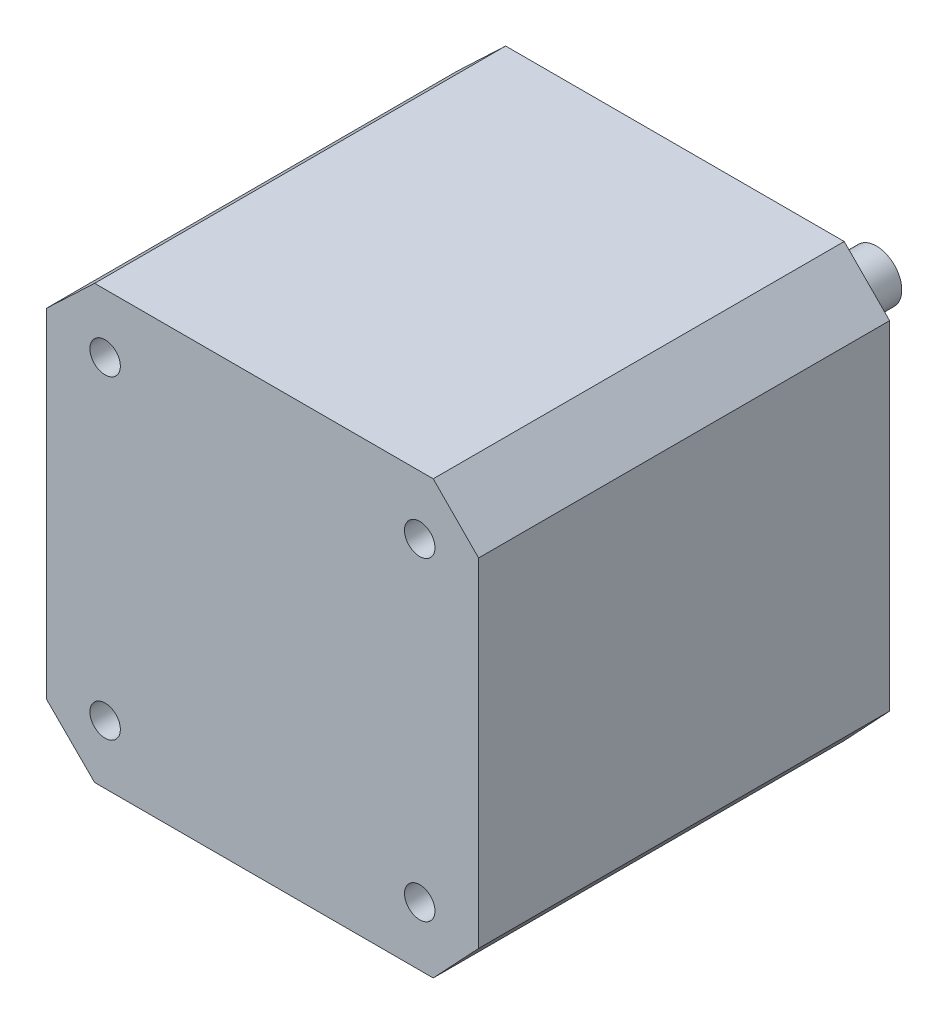
ISO-10303-21;
HEADER;
FILE_DESCRIPTION(('STEP AP214'),'2;1');
FILE_NAME('part.step','',(''),(''),'','','');
FILE_SCHEMA(('AUTOMOTIVE_DESIGN { 1 0 10303 214 1 1 1 1 }'));
ENDSEC;
DATA;
#1=APPLICATION_CONTEXT('core data for automotive mechanical design processes');
#2=APPLICATION_PROTOCOL_DEFINITION('international standard','automotive_design',2000,#1);
#3=PRODUCT_CONTEXT('',#1,'mechanical');
#4=PRODUCT('Part','Part','',(#3));
#5=PRODUCT_RELATED_PRODUCT_CATEGORY('part','',(#4));
#6=PRODUCT_DEFINITION_FORMATION('','',#4);
#7=PRODUCT_DEFINITION_CONTEXT('part definition',#1,'design');
#8=PRODUCT_DEFINITION('design','',#6,#7);
#9=PRODUCT_DEFINITION_SHAPE('','',#8);
#10=(LENGTH_UNIT() NAMED_UNIT(*) SI_UNIT(.MILLI.,.METRE.));
#11=(NAMED_UNIT(*) PLANE_ANGLE_UNIT() SI_UNIT($,.RADIAN.));
#12=(NAMED_UNIT(*) SI_UNIT($,.STERADIAN.) SOLID_ANGLE_UNIT());
#13=UNCERTAINTY_MEASURE_WITH_UNIT(LENGTH_MEASURE(1.E-05),#10,'distance_accuracy_value','');
#14=(GEOMETRIC_REPRESENTATION_CONTEXT(3) GLOBAL_UNCERTAINTY_ASSIGNED_CONTEXT((#13)) GLOBAL_UNIT_ASSIGNED_CONTEXT((#10,
#11,#12)) REPRESENTATION_CONTEXT('',''));
#15=CARTESIAN_POINT('',(0.,0.,0.));
#16=DIRECTION('',(0.,0.,1.));
#17=DIRECTION('',(1.,0.,0.));
#18=AXIS2_PLACEMENT_3D('',#15,#16,#17);
#19=CARTESIAN_POINT('',(21.3,-4.1,-2.));
#20=DIRECTION('',(0.,0.,-1.));
#21=DIRECTION('',(-1.,0.,0.));
#22=AXIS2_PLACEMENT_3D('',#19,#20,#21);
#23=PLANE('',#22);
#24=CARTESIAN_POINT('',(21.3,-4.1,-2.));
#25=DIRECTION('',(0.,0.,-1.));
#26=DIRECTION('',(-1.,0.,0.));
#27=AXIS2_PLACEMENT_3D('',#24,#25,#26);
#28=CIRCLE('',#27,11.);
#29=CARTESIAN_POINT('',(10.3,-4.1,-2.));
#30=VERTEX_POINT('',#29);
#31=EDGE_CURVE('E366',#30,#30,#28,.T.);
#32=ORIENTED_EDGE('',*,*,#31,.T.);
#33=EDGE_LOOP('',(#32));
#34=FACE_BOUND('',#33,.T.);
#35=CARTESIAN_POINT('',(21.3,-4.1,-2.));
#36=DIRECTION('',(0.,0.,-1.));
#37=DIRECTION('',(-1.,0.,0.));
#38=AXIS2_PLACEMENT_3D('',#35,#36,#37);
#39=CIRCLE('',#38,2.5);
#40=CARTESIAN_POINT('',(18.8,-4.1,-2.));
#41=VERTEX_POINT('',#40);
#42=EDGE_CURVE('E363',#41,#41,#39,.T.);
#43=ORIENTED_EDGE('',*,*,#42,.F.);
#44=EDGE_LOOP('',(#43));
#45=FACE_BOUND('',#44,.T.);
#46=ADVANCED_FACE('F44',(#34,#45),#23,.T.);
#47=CARTESIAN_POINT('',(0.,17.2,0.));
#48=DIRECTION('',(0.,0.,-1.));
#49=DIRECTION('',(-1.,0.,0.));
#50=AXIS2_PLACEMENT_3D('',#47,#48,#49);
#51=PLANE('',#50);
#52=CARTESIAN_POINT('',(36.8,11.4,0.));
#53=DIRECTION('',(0.,0.,1.));
#54=DIRECTION('',(1.,0.,0.));
#55=AXIS2_PLACEMENT_3D('',#52,#53,#54);
#56=CIRCLE('',#55,1.5);
#57=CARTESIAN_POINT('',(38.3,11.4,0.));
#58=VERTEX_POINT('',#57);
#59=EDGE_CURVE('E181',#58,#58,#56,.T.);
#60=ORIENTED_EDGE('',*,*,#59,.T.);
#61=EDGE_LOOP('',(#60));
#62=FACE_BOUND('',#61,.T.);
#63=CARTESIAN_POINT('',(5.8,-19.6,0.));
#64=DIRECTION('',(0.,0.,1.));
#65=DIRECTION('',(1.,0.,0.));
#66=AXIS2_PLACEMENT_3D('',#63,#64,#65);
#67=CIRCLE('',#66,1.5);
#68=CARTESIAN_POINT('',(7.3,-19.6,0.));
#69=VERTEX_POINT('',#68);
#70=EDGE_CURVE('E193',#69,#69,#67,.T.);
#71=ORIENTED_EDGE('',*,*,#70,.T.);
#72=EDGE_LOOP('',(#71));
#73=FACE_BOUND('',#72,.T.);
#74=CARTESIAN_POINT('',(5.79999999999999,11.4,0.));
#75=DIRECTION('',(0.,0.,1.));
#76=DIRECTION('',(1.,0.,0.));
#77=AXIS2_PLACEMENT_3D('',#74,#75,#76);
#78=CIRCLE('',#77,1.5);
#79=CARTESIAN_POINT('',(7.29999999999999,11.4,0.));
#80=VERTEX_POINT('',#79);
#81=EDGE_CURVE('E199',#80,#80,#78,.T.);
#82=ORIENTED_EDGE('',*,*,#81,.T.);
#83=EDGE_LOOP('',(#82));
#84=FACE_BOUND('',#83,.T.);
#85=CARTESIAN_POINT('',(36.8,-19.6,0.));
#86=DIRECTION('',(0.,0.,1.));
#87=DIRECTION('',(1.,0.,0.));
#88=AXIS2_PLACEMENT_3D('',#85,#86,#87);
#89=CIRCLE('',#88,1.5);
#90=CARTESIAN_POINT('',(38.3,-19.6,0.));
#91=VERTEX_POINT('',#90);
#92=EDGE_CURVE('E187',#91,#91,#89,.T.);
#93=ORIENTED_EDGE('',*,*,#92,.T.);
#94=EDGE_LOOP('',(#93));
#95=FACE_BOUND('',#94,.T.);
#96=DIRECTION('',(0.684699078492722,0.72882588586796,0.));
#97=VECTOR('',#96,1.);
#98=CARTESIAN_POINT('',(38.1281944881197,-25.4,0.));
#99=LINE('',#98,#97);
#100=CARTESIAN_POINT('',(38.1281944881197,-25.4,0.));
#101=VERTEX_POINT('',#100);
#102=CARTESIAN_POINT('',(42.6,-20.64,0.));
#103=VERTEX_POINT('',#102);
#104=EDGE_CURVE('E61',#101,#103,#99,.T.);
#105=ORIENTED_EDGE('',*,*,#104,.F.);
#106=DIRECTION('',(1.,0.,0.));
#107=VECTOR('',#106,1.);
#108=CARTESIAN_POINT('',(0.,-25.4,0.));
#109=LINE('',#108,#107);
#110=CARTESIAN_POINT('',(4.76444796255505,-25.4,0.));
#111=VERTEX_POINT('',#110);
#112=EDGE_CURVE('E125',#111,#101,#109,.T.);
#113=ORIENTED_EDGE('',*,*,#112,.F.);
#114=DIRECTION('',(0.707436926277013,-0.706776481880752,0.));
#115=VECTOR('',#114,1.);
#116=CARTESIAN_POINT('',(4.76444796255506,-25.4,0.));
#117=LINE('',#116,#115);
#118=CARTESIAN_POINT('',(0.,-20.64,0.));
#119=VERTEX_POINT('',#118);
#120=EDGE_CURVE('E174',#119,#111,#117,.T.);
#121=ORIENTED_EDGE('',*,*,#120,.F.);
#122=DIRECTION('',(0.,-1.,0.));
#123=VECTOR('',#122,1.);
#124=CARTESIAN_POINT('',(0.,-25.4,0.));
#125=LINE('',#124,#123);
#126=CARTESIAN_POINT('',(0.,12.6802455688297,0.));
#127=VERTEX_POINT('',#126);
#128=EDGE_CURVE('E138',#127,#119,#125,.T.);
#129=ORIENTED_EDGE('',*,*,#128,.F.);
#130=DIRECTION('',(-0.725491286874511,-0.688231351123418,0.));
#131=VECTOR('',#130,1.);
#132=CARTESIAN_POINT('',(4.76444796255506,17.2,0.));
#133=LINE('',#132,#131);
#134=CARTESIAN_POINT('',(4.76444796255506,17.2,0.));
#135=VERTEX_POINT('',#134);
#136=EDGE_CURVE('E158',#135,#127,#133,.T.);
#137=ORIENTED_EDGE('',*,*,#136,.F.);
#138=DIRECTION('',(-1.,0.,0.));
#139=VECTOR('',#138,1.);
#140=CARTESIAN_POINT('',(0.,17.2,0.));
#141=LINE('',#140,#139);
#142=CARTESIAN_POINT('',(38.1281944881197,17.2,0.));
#143=VERTEX_POINT('',#142);
#144=EDGE_CURVE('E48',#143,#135,#141,.T.);
#145=ORIENTED_EDGE('',*,*,#144,.F.);
#146=DIRECTION('',(-0.703326021884924,0.710867432746449,0.));
#147=VECTOR('',#146,1.);
#148=CARTESIAN_POINT('',(38.1281944881197,17.2,0.));
#149=LINE('',#148,#147);
#150=CARTESIAN_POINT('',(42.6,12.6802455688297,0.));
#151=VERTEX_POINT('',#150);
#152=EDGE_CURVE('E69',#151,#143,#149,.T.);
#153=ORIENTED_EDGE('',*,*,#152,.F.);
#154=DIRECTION('',(0.,1.,0.));
#155=VECTOR('',#154,1.);
#156=CARTESIAN_POINT('',(42.6,17.2,0.));
#157=LINE('',#156,#155);
#158=EDGE_CURVE('E141',#103,#151,#157,.T.);
#159=ORIENTED_EDGE('',*,*,#158,.F.);
#160=EDGE_LOOP('',(#105,#113,#121,#129,#137,#145,#153,#159));
#161=FACE_BOUND('',#160,.T.);
#162=CARTESIAN_POINT('',(21.3,-4.1,0.));
#163=DIRECTION('',(0.,0.,-1.));
#164=DIRECTION('',(-1.,0.,0.));
#165=AXIS2_PLACEMENT_3D('',#162,#163,#164);
#166=CIRCLE('',#165,11.);
#167=CARTESIAN_POINT('',(10.3,-4.1,0.));
#168=VERTEX_POINT('',#167);
#169=EDGE_CURVE('E362',#168,#168,#166,.T.);
#170=ORIENTED_EDGE('',*,*,#169,.F.);
#171=EDGE_LOOP('',(#170));
#172=FACE_BOUND('',#171,.T.);
#173=ADVANCED_FACE('F165',(#62,#73,#84,#95,#161,#172),#51,.T.);
#174=CARTESIAN_POINT('',(0.,17.2,40.5));
#175=DIRECTION('',(0.,0.,-1.));
#176=DIRECTION('',(-1.,0.,0.));
#177=AXIS2_PLACEMENT_3D('',#174,#175,#176);
#178=PLANE('',#177);
#179=CARTESIAN_POINT('',(36.8,-19.6,40.5));
#180=DIRECTION('',(0.,0.,1.));
#181=DIRECTION('',(1.,0.,0.));
#182=AXIS2_PLACEMENT_3D('',#179,#180,#181);
#183=CIRCLE('',#182,1.5);
#184=CARTESIAN_POINT('',(38.3,-19.6,40.5));
#185=VERTEX_POINT('',#184);
#186=EDGE_CURVE('E190',#185,#185,#183,.T.);
#187=ORIENTED_EDGE('',*,*,#186,.F.);
#188=EDGE_LOOP('',(#187));
#189=FACE_BOUND('',#188,.T.);
#190=CARTESIAN_POINT('',(5.8,11.4,40.5));
#191=DIRECTION('',(0.,0.,1.));
#192=DIRECTION('',(1.,0.,0.));
#193=AXIS2_PLACEMENT_3D('',#190,#191,#192);
#194=CIRCLE('',#193,1.5);
#195=CARTESIAN_POINT('',(7.3,11.4,40.5));
#196=VERTEX_POINT('',#195);
#197=EDGE_CURVE('E140',#196,#196,#194,.T.);
#198=ORIENTED_EDGE('',*,*,#197,.F.);
#199=EDGE_LOOP('',(#198));
#200=FACE_BOUND('',#199,.T.);
#201=DIRECTION('',(1.,0.,0.));
#202=VECTOR('',#201,1.);
#203=CARTESIAN_POINT('',(0.,-25.4,40.5));
#204=LINE('',#203,#202);
#205=CARTESIAN_POINT('',(4.76444796255506,-25.4,40.5));
#206=VERTEX_POINT('',#205);
#207=CARTESIAN_POINT('',(38.1281944881197,-25.4,40.5));
#208=VERTEX_POINT('',#207);
#209=EDGE_CURVE('E123',#206,#208,#204,.T.);
#210=ORIENTED_EDGE('',*,*,#209,.T.);
#211=DIRECTION('',(0.684699078492722,0.72882588586796,0.));
#212=VECTOR('',#211,1.);
#213=CARTESIAN_POINT('',(38.1281944881197,-25.4,40.5));
#214=LINE('',#213,#212);
#215=CARTESIAN_POINT('',(42.6,-20.64,40.5));
#216=VERTEX_POINT('',#215);
#217=EDGE_CURVE('E109',#208,#216,#214,.T.);
#218=ORIENTED_EDGE('',*,*,#217,.T.);
#219=DIRECTION('',(0.,1.,0.));
#220=VECTOR('',#219,1.);
#221=CARTESIAN_POINT('',(42.6,17.2,40.5));
#222=LINE('',#221,#220);
#223=CARTESIAN_POINT('',(42.6,12.6802455688297,40.5));
#224=VERTEX_POINT('',#223);
#225=EDGE_CURVE('E53',#216,#224,#222,.T.);
#226=ORIENTED_EDGE('',*,*,#225,.T.);
#227=DIRECTION('',(-0.703326021884924,0.710867432746449,0.));
#228=VECTOR('',#227,1.);
#229=CARTESIAN_POINT('',(38.1281944881197,17.2,40.5));
#230=LINE('',#229,#228);
#231=CARTESIAN_POINT('',(38.1281944881197,17.2,40.5));
#232=VERTEX_POINT('',#231);
#233=EDGE_CURVE('E374',#224,#232,#230,.T.);
#234=ORIENTED_EDGE('',*,*,#233,.T.);
#235=DIRECTION('',(-1.,0.,0.));
#236=VECTOR('',#235,1.);
#237=CARTESIAN_POINT('',(0.,17.2,40.5));
#238=LINE('',#237,#236);
#239=CARTESIAN_POINT('',(4.76444796255505,17.2,40.5));
#240=VERTEX_POINT('',#239);
#241=EDGE_CURVE('E13',#232,#240,#238,.T.);
#242=ORIENTED_EDGE('',*,*,#241,.T.);
#243=DIRECTION('',(-0.725491286874511,-0.688231351123418,0.));
#244=VECTOR('',#243,1.);
#245=CARTESIAN_POINT('',(4.76444796255506,17.2,40.5));
#246=LINE('',#245,#244);
#247=CARTESIAN_POINT('',(0.,12.6802455688297,40.5));
#248=VERTEX_POINT('',#247);
#249=EDGE_CURVE('E161',#240,#248,#246,.T.);
#250=ORIENTED_EDGE('',*,*,#249,.T.);
#251=DIRECTION('',(0.,-1.,0.));
#252=VECTOR('',#251,1.);
#253=CARTESIAN_POINT('',(0.,-25.4,40.5));
#254=LINE('',#253,#252);
#255=CARTESIAN_POINT('',(0.,-20.64,40.5));
#256=VERTEX_POINT('',#255);
#257=EDGE_CURVE('E132',#248,#256,#254,.T.);
#258=ORIENTED_EDGE('',*,*,#257,.T.);
#259=DIRECTION('',(0.707436926277013,-0.706776481880752,0.));
#260=VECTOR('',#259,1.);
#261=CARTESIAN_POINT('',(4.76444796255506,-25.4,40.5));
#262=LINE('',#261,#260);
#263=EDGE_CURVE('E131',#256,#206,#262,.T.);
#264=ORIENTED_EDGE('',*,*,#263,.T.);
#265=EDGE_LOOP('',(#210,#218,#226,#234,#242,#250,#258,#264));
#266=FACE_BOUND('',#265,.T.);
#267=CARTESIAN_POINT('',(5.8,-19.6,40.5));
#268=DIRECTION('',(0.,0.,1.));
#269=DIRECTION('',(1.,0.,0.));
#270=AXIS2_PLACEMENT_3D('',#267,#268,#269);
#271=CIRCLE('',#270,1.5);
#272=CARTESIAN_POINT('',(7.3,-19.6,40.5));
#273=VERTEX_POINT('',#272);
#274=EDGE_CURVE('E196',#273,#273,#271,.T.);
#275=ORIENTED_EDGE('',*,*,#274,.F.);
#276=EDGE_LOOP('',(#275));
#277=FACE_BOUND('',#276,.T.);
#278=CARTESIAN_POINT('',(36.8,11.4,40.5));
#279=DIRECTION('',(0.,0.,1.));
#280=DIRECTION('',(1.,0.,0.));
#281=AXIS2_PLACEMENT_3D('',#278,#279,#280);
#282=CIRCLE('',#281,1.5);
#283=CARTESIAN_POINT('',(38.3,11.4,40.5));
#284=VERTEX_POINT('',#283);
#285=EDGE_CURVE('E184',#284,#284,#282,.T.);
#286=ORIENTED_EDGE('',*,*,#285,.F.);
#287=EDGE_LOOP('',(#286));
#288=FACE_BOUND('',#287,.T.);
#289=ADVANCED_FACE('F128',(#189,#200,#266,#277,#288),#178,.F.);
#290=CARTESIAN_POINT('',(0.,-25.4,40.5));
#291=DIRECTION('',(1.,0.,0.));
#292=DIRECTION('',(0.,0.,-1.));
#293=AXIS2_PLACEMENT_3D('',#290,#291,#292);
#294=PLANE('',#293);
#295=ORIENTED_EDGE('',*,*,#257,.F.);
#296=DIRECTION('',(0.,0.,-1.));
#297=VECTOR('',#296,1.);
#298=CARTESIAN_POINT('',(0.,12.6802455688297,40.5));
#299=LINE('',#298,#297);
#300=EDGE_CURVE('E162',#248,#127,#299,.T.);
#301=ORIENTED_EDGE('',*,*,#300,.T.);
#302=ORIENTED_EDGE('',*,*,#128,.T.);
#303=DIRECTION('',(0.,0.,-1.));
#304=VECTOR('',#303,1.);
#305=CARTESIAN_POINT('',(0.,-20.64,40.5));
#306=LINE('',#305,#304);
#307=EDGE_CURVE('E177',#256,#119,#306,.T.);
#308=ORIENTED_EDGE('',*,*,#307,.F.);
#309=EDGE_LOOP('',(#295,#301,#302,#308));
#310=FACE_BOUND('',#309,.T.);
#311=ADVANCED_FACE('F46',(#310),#294,.F.);
#312=CARTESIAN_POINT('',(0.,-25.4,40.5));
#313=DIRECTION('',(0.,1.,0.));
#314=DIRECTION('',(0.,0.,1.));
#315=AXIS2_PLACEMENT_3D('',#312,#313,#314);
#316=PLANE('',#315);
#317=ORIENTED_EDGE('',*,*,#112,.T.);
#318=DIRECTION('',(0.,0.,-1.));
#319=VECTOR('',#318,1.);
#320=CARTESIAN_POINT('',(38.1281944881197,-25.4,40.5));
#321=LINE('',#320,#319);
#322=EDGE_CURVE('E112',#208,#101,#321,.T.);
#323=ORIENTED_EDGE('',*,*,#322,.F.);
#324=ORIENTED_EDGE('',*,*,#209,.F.);
#325=DIRECTION('',(0.,0.,-1.));
#326=VECTOR('',#325,1.);
#327=CARTESIAN_POINT('',(4.76444796255506,-25.4,40.5));
#328=LINE('',#327,#326);
#329=EDGE_CURVE('E179',#206,#111,#328,.T.);
#330=ORIENTED_EDGE('',*,*,#329,.T.);
#331=EDGE_LOOP('',(#317,#323,#324,#330));
#332=FACE_BOUND('',#331,.T.);
#333=ADVANCED_FACE('F121',(#332),#316,.F.);
#334=CARTESIAN_POINT('',(42.6,17.2,40.5));
#335=DIRECTION('',(-1.,0.,0.));
#336=DIRECTION('',(0.,0.,1.));
#337=AXIS2_PLACEMENT_3D('',#334,#335,#336);
#338=PLANE('',#337);
#339=ORIENTED_EDGE('',*,*,#225,.F.);
#340=DIRECTION('',(0.,0.,-1.));
#341=VECTOR('',#340,1.);
#342=CARTESIAN_POINT('',(42.6,-20.64,40.5));
#343=LINE('',#342,#341);
#344=EDGE_CURVE('E113',#216,#103,#343,.T.);
#345=ORIENTED_EDGE('',*,*,#344,.T.);
#346=ORIENTED_EDGE('',*,*,#158,.T.);
#347=DIRECTION('',(0.,0.,-1.));
#348=VECTOR('',#347,1.);
#349=CARTESIAN_POINT('',(42.6,12.6802455688297,40.5));
#350=LINE('',#349,#348);
#351=EDGE_CURVE('E170',#224,#151,#350,.T.);
#352=ORIENTED_EDGE('',*,*,#351,.F.);
#353=EDGE_LOOP('',(#339,#345,#346,#352));
#354=FACE_BOUND('',#353,.T.);
#355=ADVANCED_FACE('F220',(#354),#338,.F.);
#356=CARTESIAN_POINT('',(0.,17.2,40.5));
#357=DIRECTION('',(0.,-1.,0.));
#358=DIRECTION('',(0.,0.,-1.));
#359=AXIS2_PLACEMENT_3D('',#356,#357,#358);
#360=PLANE('',#359);
#361=ORIENTED_EDGE('',*,*,#241,.F.);
#362=DIRECTION('',(0.,0.,-1.));
#363=VECTOR('',#362,1.);
#364=CARTESIAN_POINT('',(38.1281944881197,17.2,40.5));
#365=LINE('',#364,#363);
#366=EDGE_CURVE('E152',#232,#143,#365,.T.);
#367=ORIENTED_EDGE('',*,*,#366,.T.);
#368=ORIENTED_EDGE('',*,*,#144,.T.);
#369=DIRECTION('',(0.,0.,-1.));
#370=VECTOR('',#369,1.);
#371=CARTESIAN_POINT('',(4.76444796255506,17.2,40.5));
#372=LINE('',#371,#370);
#373=EDGE_CURVE('E151',#240,#135,#372,.T.);
#374=ORIENTED_EDGE('',*,*,#373,.F.);
#375=EDGE_LOOP('',(#361,#367,#368,#374));
#376=FACE_BOUND('',#375,.T.);
#377=ADVANCED_FACE('F150',(#376),#360,.F.);
#378=CARTESIAN_POINT('',(5.8,11.4,40.5));
#379=DIRECTION('',(0.,0.,-1.));
#380=DIRECTION('',(-1.,0.,0.));
#381=AXIS2_PLACEMENT_3D('',#378,#379,#380);
#382=CYLINDRICAL_SURFACE('',#381,1.5);
#383=ORIENTED_EDGE('',*,*,#197,.T.);
#384=EDGE_LOOP('',(#383));
#385=FACE_BOUND('',#384,.T.);
#386=ORIENTED_EDGE('',*,*,#81,.F.);
#387=EDGE_LOOP('',(#386));
#388=FACE_BOUND('',#387,.T.);
#389=ADVANCED_FACE('F208',(#385,#388),#382,.F.);
#390=CARTESIAN_POINT('',(5.8,-19.6,40.5));
#391=DIRECTION('',(0.,0.,-1.));
#392=DIRECTION('',(-1.,0.,0.));
#393=AXIS2_PLACEMENT_3D('',#390,#391,#392);
#394=CYLINDRICAL_SURFACE('',#393,1.5);
#395=ORIENTED_EDGE('',*,*,#274,.T.);
#396=EDGE_LOOP('',(#395));
#397=FACE_BOUND('',#396,.T.);
#398=ORIENTED_EDGE('',*,*,#70,.F.);
#399=EDGE_LOOP('',(#398));
#400=FACE_BOUND('',#399,.T.);
#401=ADVANCED_FACE('F210',(#397,#400),#394,.F.);
#402=CARTESIAN_POINT('',(36.8,-19.6,40.5));
#403=DIRECTION('',(0.,0.,-1.));
#404=DIRECTION('',(-1.,0.,0.));
#405=AXIS2_PLACEMENT_3D('',#402,#403,#404);
#406=CYLINDRICAL_SURFACE('',#405,1.5);
#407=ORIENTED_EDGE('',*,*,#186,.T.);
#408=EDGE_LOOP('',(#407));
#409=FACE_BOUND('',#408,.T.);
#410=ORIENTED_EDGE('',*,*,#92,.F.);
#411=EDGE_LOOP('',(#410));
#412=FACE_BOUND('',#411,.T.);
#413=ADVANCED_FACE('F217',(#409,#412),#406,.F.);
#414=CARTESIAN_POINT('',(36.8,11.4,40.5));
#415=DIRECTION('',(0.,0.,-1.));
#416=DIRECTION('',(-1.,0.,0.));
#417=AXIS2_PLACEMENT_3D('',#414,#415,#416);
#418=CYLINDRICAL_SURFACE('',#417,1.5);
#419=ORIENTED_EDGE('',*,*,#285,.T.);
#420=EDGE_LOOP('',(#419));
#421=FACE_BOUND('',#420,.T.);
#422=ORIENTED_EDGE('',*,*,#59,.F.);
#423=EDGE_LOOP('',(#422));
#424=FACE_BOUND('',#423,.T.);
#425=ADVANCED_FACE('F251',(#421,#424),#418,.F.);
#426=CARTESIAN_POINT('',(4.76444796255506,-25.4,40.5));
#427=DIRECTION('',(0.706776481880752,0.707436926277013,0.));
#428=DIRECTION('',(-0.707436926277013,0.706776481880752,0.));
#429=AXIS2_PLACEMENT_3D('',#426,#427,#428);
#430=PLANE('',#429);
#431=ORIENTED_EDGE('',*,*,#120,.T.);
#432=ORIENTED_EDGE('',*,*,#329,.F.);
#433=ORIENTED_EDGE('',*,*,#263,.F.);
#434=ORIENTED_EDGE('',*,*,#307,.T.);
#435=EDGE_LOOP('',(#431,#432,#433,#434));
#436=FACE_BOUND('',#435,.T.);
#437=ADVANCED_FACE('F248',(#436),#430,.F.);
#438=CARTESIAN_POINT('',(4.76444796255506,17.2,40.5));
#439=DIRECTION('',(0.688231351123418,-0.725491286874511,0.));
#440=DIRECTION('',(0.725491286874511,0.688231351123418,0.));
#441=AXIS2_PLACEMENT_3D('',#438,#439,#440);
#442=PLANE('',#441);
#443=ORIENTED_EDGE('',*,*,#136,.T.);
#444=ORIENTED_EDGE('',*,*,#300,.F.);
#445=ORIENTED_EDGE('',*,*,#249,.F.);
#446=ORIENTED_EDGE('',*,*,#373,.T.);
#447=EDGE_LOOP('',(#443,#444,#445,#446));
#448=FACE_BOUND('',#447,.T.);
#449=ADVANCED_FACE('F157',(#448),#442,.F.);
#450=CARTESIAN_POINT('',(38.1281944881197,17.2,40.5));
#451=DIRECTION('',(-0.710867432746449,-0.703326021884924,0.));
#452=DIRECTION('',(0.703326021884924,-0.710867432746449,0.));
#453=AXIS2_PLACEMENT_3D('',#450,#451,#452);
#454=PLANE('',#453);
#455=ORIENTED_EDGE('',*,*,#152,.T.);
#456=ORIENTED_EDGE('',*,*,#366,.F.);
#457=ORIENTED_EDGE('',*,*,#233,.F.);
#458=ORIENTED_EDGE('',*,*,#351,.T.);
#459=EDGE_LOOP('',(#455,#456,#457,#458));
#460=FACE_BOUND('',#459,.T.);
#461=ADVANCED_FACE('F243',(#460),#454,.F.);
#462=CARTESIAN_POINT('',(38.1281944881197,-25.4,40.5));
#463=DIRECTION('',(-0.72882588586796,0.684699078492722,0.));
#464=DIRECTION('',(-0.684699078492722,-0.72882588586796,0.));
#465=AXIS2_PLACEMENT_3D('',#462,#463,#464);
#466=PLANE('',#465);
#467=ORIENTED_EDGE('',*,*,#104,.T.);
#468=ORIENTED_EDGE('',*,*,#344,.F.);
#469=ORIENTED_EDGE('',*,*,#217,.F.);
#470=ORIENTED_EDGE('',*,*,#322,.T.);
#471=EDGE_LOOP('',(#467,#468,#469,#470));
#472=FACE_BOUND('',#471,.T.);
#473=ADVANCED_FACE('F111',(#472),#466,.F.);
#474=CARTESIAN_POINT('',(21.3,-4.1,-2.));
#475=DIRECTION('',(0.,0.,1.));
#476=DIRECTION('',(1.,0.,0.));
#477=AXIS2_PLACEMENT_3D('',#474,#475,#476);
#478=CYLINDRICAL_SURFACE('',#477,11.);
#479=ORIENTED_EDGE('',*,*,#31,.F.);
#480=EDGE_LOOP('',(#479));
#481=FACE_BOUND('',#480,.T.);
#482=ORIENTED_EDGE('',*,*,#169,.T.);
#483=EDGE_LOOP('',(#482));
#484=FACE_BOUND('',#483,.T.);
#485=ADVANCED_FACE('F237',(#481,#484),#478,.T.);
#486=CARTESIAN_POINT('',(21.3,-4.1,-20.));
#487=DIRECTION('',(0.,0.,1.));
#488=DIRECTION('',(1.,0.,0.));
#489=AXIS2_PLACEMENT_3D('',#486,#487,#488);
#490=CYLINDRICAL_SURFACE('',#489,2.5);
#491=CARTESIAN_POINT('',(21.3,-4.1,-20.));
#492=DIRECTION('',(0.,0.,-1.));
#493=DIRECTION('',(-1.,0.,0.));
#494=AXIS2_PLACEMENT_3D('',#491,#492,#493);
#495=CIRCLE('',#494,2.5);
#496=CARTESIAN_POINT('',(18.8,-4.1,-20.));
#497=VERTEX_POINT('',#496);
#498=EDGE_CURVE('E361',#497,#497,#495,.T.);
#499=ORIENTED_EDGE('',*,*,#498,.F.);
#500=EDGE_LOOP('',(#499));
#501=FACE_BOUND('',#500,.T.);
#502=ORIENTED_EDGE('',*,*,#42,.T.);
#503=EDGE_LOOP('',(#502));
#504=FACE_BOUND('',#503,.T.);
#505=ADVANCED_FACE('F235',(#501,#504),#490,.T.);
#506=CARTESIAN_POINT('',(21.3,-4.1,-20.));
#507=DIRECTION('',(0.,0.,-1.));
#508=DIRECTION('',(-1.,0.,0.));
#509=AXIS2_PLACEMENT_3D('',#506,#507,#508);
#510=PLANE('',#509);
#511=ORIENTED_EDGE('',*,*,#498,.T.);
#512=EDGE_LOOP('',(#511));
#513=FACE_BOUND('',#512,.T.);
#514=ADVANCED_FACE('F347',(#513),#510,.T.);
#515=CLOSED_SHELL('',(#46,#173,#289,#311,#333,#355,#377,#389,#401,#413,#425,#437,#449,#461,#473,
#485,#505,#514));
#516=MANIFOLD_SOLID_BREP('B2',#515);
#517=ADVANCED_BREP_SHAPE_REPRESENTATION('',(#18,#516),#14);
#518=SHAPE_DEFINITION_REPRESENTATION(#9,#517);
ENDSEC;
END-ISO-10303-21;
